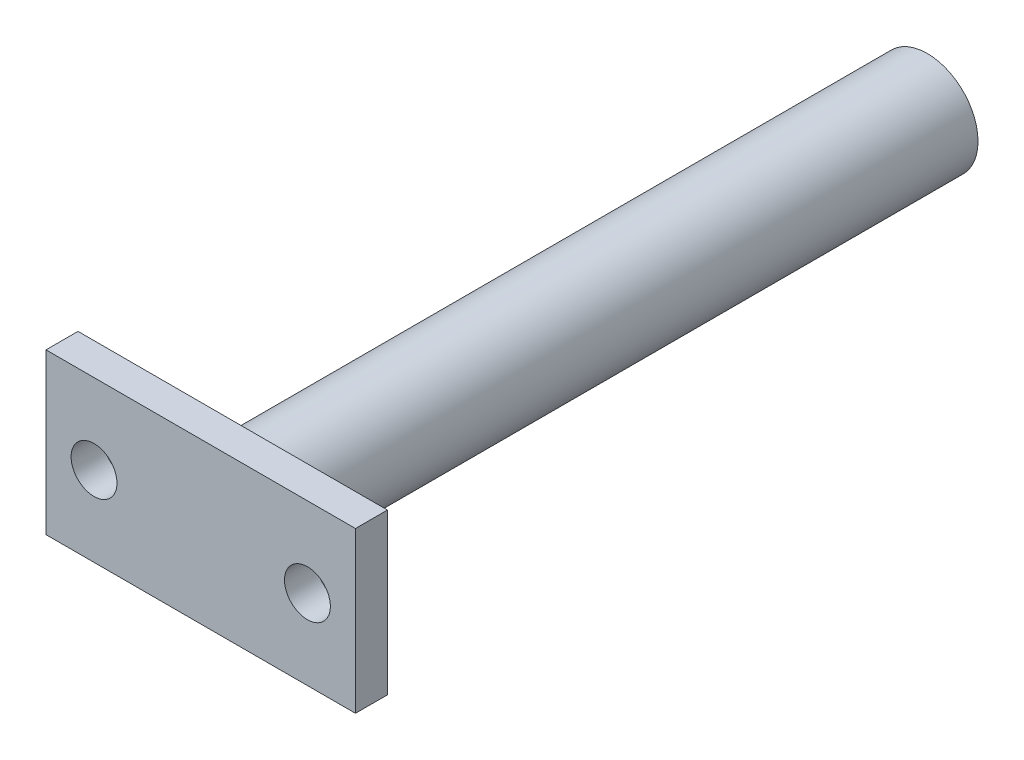
ISO-10303-21;
HEADER;
FILE_DESCRIPTION(('STEP AP214'),'2;1');
FILE_NAME('part.step','',(''),(''),'','','');
FILE_SCHEMA(('AUTOMOTIVE_DESIGN { 1 0 10303 214 1 1 1 1 }'));
ENDSEC;
DATA;
#1=APPLICATION_CONTEXT('core data for automotive mechanical design processes');
#2=APPLICATION_PROTOCOL_DEFINITION('international standard','automotive_design',2000,#1);
#3=PRODUCT_CONTEXT('',#1,'mechanical');
#4=PRODUCT('Part','Part','',(#3));
#5=PRODUCT_RELATED_PRODUCT_CATEGORY('part','',(#4));
#6=PRODUCT_DEFINITION_FORMATION('','',#4);
#7=PRODUCT_DEFINITION_CONTEXT('part definition',#1,'design');
#8=PRODUCT_DEFINITION('design','',#6,#7);
#9=PRODUCT_DEFINITION_SHAPE('','',#8);
#10=(LENGTH_UNIT() NAMED_UNIT(*) SI_UNIT(.MILLI.,.METRE.));
#11=(NAMED_UNIT(*) PLANE_ANGLE_UNIT() SI_UNIT($,.RADIAN.));
#12=(NAMED_UNIT(*) SI_UNIT($,.STERADIAN.) SOLID_ANGLE_UNIT());
#13=UNCERTAINTY_MEASURE_WITH_UNIT(LENGTH_MEASURE(1.E-05),#10,'distance_accuracy_value','');
#14=(GEOMETRIC_REPRESENTATION_CONTEXT(3) GLOBAL_UNCERTAINTY_ASSIGNED_CONTEXT((#13)) GLOBAL_UNIT_ASSIGNED_CONTEXT((#10,
#11,#12)) REPRESENTATION_CONTEXT('',''));
#15=CARTESIAN_POINT('',(0.,0.,0.));
#16=DIRECTION('',(0.,0.,1.));
#17=DIRECTION('',(1.,0.,0.));
#18=AXIS2_PLACEMENT_3D('',#15,#16,#17);
#19=CARTESIAN_POINT('',(-27.6328666396553,0.,3.));
#20=DIRECTION('',(-1.,0.,0.));
#21=DIRECTION('',(0.,0.,1.));
#22=AXIS2_PLACEMENT_3D('',#19,#20,#21);
#23=PLANE('',#22);
#24=DIRECTION('',(0.,1.,0.));
#25=VECTOR('',#24,1.);
#26=CARTESIAN_POINT('',(-27.6328666396553,0.,0.));
#27=LINE('',#26,#25);
#28=CARTESIAN_POINT('',(-27.6328666396553,0.593964388251606,0.));
#29=VERTEX_POINT('',#28);
#30=CARTESIAN_POINT('',(-27.6328666396553,15.5939643882516,0.));
#31=VERTEX_POINT('',#30);
#32=EDGE_CURVE('E106',#29,#31,#27,.T.);
#33=ORIENTED_EDGE('',*,*,#32,.F.);
#34=DIRECTION('',(0.,0.,-1.));
#35=VECTOR('',#34,1.);
#36=CARTESIAN_POINT('',(-27.6328666396553,0.593964388251606,3.));
#37=LINE('',#36,#35);
#38=CARTESIAN_POINT('',(-27.6328666396553,0.593964388251606,3.));
#39=VERTEX_POINT('',#38);
#40=EDGE_CURVE('E11',#39,#29,#37,.T.);
#41=ORIENTED_EDGE('',*,*,#40,.F.);
#42=DIRECTION('',(0.,1.,0.));
#43=VECTOR('',#42,1.);
#44=CARTESIAN_POINT('',(-27.6328666396553,0.,3.));
#45=LINE('',#44,#43);
#46=CARTESIAN_POINT('',(-27.6328666396553,15.5939643882516,3.));
#47=VERTEX_POINT('',#46);
#48=EDGE_CURVE('E90',#39,#47,#45,.T.);
#49=ORIENTED_EDGE('',*,*,#48,.T.);
#50=DIRECTION('',(0.,0.,-1.));
#51=VECTOR('',#50,1.);
#52=CARTESIAN_POINT('',(-27.6328666396553,15.5939643882516,3.));
#53=LINE('',#52,#51);
#54=EDGE_CURVE('E52',#47,#31,#53,.T.);
#55=ORIENTED_EDGE('',*,*,#54,.T.);
#56=EDGE_LOOP('',(#33,#41,#49,#55));
#57=FACE_BOUND('',#56,.T.);
#58=ADVANCED_FACE('F35',(#57),#23,.T.);
#59=CARTESIAN_POINT('',(0.,0.593964388251606,3.));
#60=DIRECTION('',(0.,1.,0.));
#61=DIRECTION('',(0.,0.,1.));
#62=AXIS2_PLACEMENT_3D('',#59,#60,#61);
#63=PLANE('',#62);
#64=DIRECTION('',(1.,0.,0.));
#65=VECTOR('',#64,1.);
#66=CARTESIAN_POINT('',(0.,0.593964388251606,0.));
#67=LINE('',#66,#65);
#68=CARTESIAN_POINT('',(1.3671333603447,0.593964388251606,0.));
#69=VERTEX_POINT('',#68);
#70=EDGE_CURVE('E95',#29,#69,#67,.T.);
#71=ORIENTED_EDGE('',*,*,#70,.T.);
#72=DIRECTION('',(0.,0.,-1.));
#73=VECTOR('',#72,1.);
#74=CARTESIAN_POINT('',(1.3671333603447,0.593964388251606,3.));
#75=LINE('',#74,#73);
#76=CARTESIAN_POINT('',(1.3671333603447,0.593964388251606,3.));
#77=VERTEX_POINT('',#76);
#78=EDGE_CURVE('E44',#77,#69,#75,.T.);
#79=ORIENTED_EDGE('',*,*,#78,.F.);
#80=DIRECTION('',(1.,0.,0.));
#81=VECTOR('',#80,1.);
#82=CARTESIAN_POINT('',(0.,0.593964388251606,3.));
#83=LINE('',#82,#81);
#84=EDGE_CURVE('E86',#39,#77,#83,.T.);
#85=ORIENTED_EDGE('',*,*,#84,.F.);
#86=ORIENTED_EDGE('',*,*,#40,.T.);
#87=EDGE_LOOP('',(#71,#79,#85,#86));
#88=FACE_BOUND('',#87,.T.);
#89=ADVANCED_FACE('F93',(#88),#63,.F.);
#90=CARTESIAN_POINT('',(1.3671333603447,0.,3.));
#91=DIRECTION('',(-1.,0.,0.));
#92=DIRECTION('',(0.,-1.,0.));
#93=AXIS2_PLACEMENT_3D('',#90,#91,#92);
#94=PLANE('',#93);
#95=DIRECTION('',(0.,1.,0.));
#96=VECTOR('',#95,1.);
#97=CARTESIAN_POINT('',(1.3671333603447,0.,0.));
#98=LINE('',#97,#96);
#99=CARTESIAN_POINT('',(1.3671333603447,15.5939643882516,0.));
#100=VERTEX_POINT('',#99);
#101=EDGE_CURVE('E103',#69,#100,#98,.T.);
#102=ORIENTED_EDGE('',*,*,#101,.T.);
#103=DIRECTION('',(0.,0.,-1.));
#104=VECTOR('',#103,1.);
#105=CARTESIAN_POINT('',(1.3671333603447,15.5939643882516,3.));
#106=LINE('',#105,#104);
#107=CARTESIAN_POINT('',(1.3671333603447,15.5939643882516,3.));
#108=VERTEX_POINT('',#107);
#109=EDGE_CURVE('E66',#108,#100,#106,.T.);
#110=ORIENTED_EDGE('',*,*,#109,.F.);
#111=DIRECTION('',(0.,1.,0.));
#112=VECTOR('',#111,1.);
#113=CARTESIAN_POINT('',(1.3671333603447,0.,3.));
#114=LINE('',#113,#112);
#115=EDGE_CURVE('E78',#77,#108,#114,.T.);
#116=ORIENTED_EDGE('',*,*,#115,.F.);
#117=ORIENTED_EDGE('',*,*,#78,.T.);
#118=EDGE_LOOP('',(#102,#110,#116,#117));
#119=FACE_BOUND('',#118,.T.);
#120=ADVANCED_FACE('F80',(#119),#94,.F.);
#121=CARTESIAN_POINT('',(-3.1328666396553,8.09396438825161,3.));
#122=DIRECTION('',(0.,0.,-1.));
#123=DIRECTION('',(-1.,0.,0.));
#124=AXIS2_PLACEMENT_3D('',#121,#122,#123);
#125=CYLINDRICAL_SURFACE('',#124,2.15);
#126=CARTESIAN_POINT('',(-3.1328666396553,8.09396438825161,3.));
#127=DIRECTION('',(0.,0.,1.));
#128=DIRECTION('',(1.,0.,0.));
#129=AXIS2_PLACEMENT_3D('',#126,#127,#128);
#130=CIRCLE('',#129,2.15);
#131=CARTESIAN_POINT('',(-0.982866639655303,8.09396438825161,3.));
#132=VERTEX_POINT('',#131);
#133=EDGE_CURVE('E117',#132,#132,#130,.T.);
#134=ORIENTED_EDGE('',*,*,#133,.T.);
#135=EDGE_LOOP('',(#134));
#136=FACE_BOUND('',#135,.T.);
#137=CARTESIAN_POINT('',(-3.1328666396553,8.09396438825161,0.));
#138=DIRECTION('',(0.,0.,1.));
#139=DIRECTION('',(1.,0.,0.));
#140=AXIS2_PLACEMENT_3D('',#137,#138,#139);
#141=CIRCLE('',#140,2.15);
#142=CARTESIAN_POINT('',(-0.982866639655303,8.09396438825161,0.));
#143=VERTEX_POINT('',#142);
#144=EDGE_CURVE('E108',#143,#143,#141,.T.);
#145=ORIENTED_EDGE('',*,*,#144,.F.);
#146=EDGE_LOOP('',(#145));
#147=FACE_BOUND('',#146,.T.);
#148=ADVANCED_FACE('F149',(#136,#147),#125,.F.);
#149=CARTESIAN_POINT('',(-23.1328666396553,8.09396438825161,3.));
#150=DIRECTION('',(0.,0.,-1.));
#151=DIRECTION('',(-1.,0.,0.));
#152=AXIS2_PLACEMENT_3D('',#149,#150,#151);
#153=CYLINDRICAL_SURFACE('',#152,2.15);
#154=CARTESIAN_POINT('',(-23.1328666396553,8.09396438825161,3.));
#155=DIRECTION('',(0.,0.,1.));
#156=DIRECTION('',(1.,0.,0.));
#157=AXIS2_PLACEMENT_3D('',#154,#155,#156);
#158=CIRCLE('',#157,2.15);
#159=CARTESIAN_POINT('',(-20.9828666396553,8.09396438825161,3.));
#160=VERTEX_POINT('',#159);
#161=EDGE_CURVE('E102',#160,#160,#158,.T.);
#162=ORIENTED_EDGE('',*,*,#161,.T.);
#163=EDGE_LOOP('',(#162));
#164=FACE_BOUND('',#163,.T.);
#165=CARTESIAN_POINT('',(-23.1328666396553,8.09396438825161,0.));
#166=DIRECTION('',(0.,0.,1.));
#167=DIRECTION('',(1.,0.,0.));
#168=AXIS2_PLACEMENT_3D('',#165,#166,#167);
#169=CIRCLE('',#168,2.15);
#170=CARTESIAN_POINT('',(-20.9828666396553,8.09396438825161,0.));
#171=VERTEX_POINT('',#170);
#172=EDGE_CURVE('E111',#171,#171,#169,.T.);
#173=ORIENTED_EDGE('',*,*,#172,.F.);
#174=EDGE_LOOP('',(#173));
#175=FACE_BOUND('',#174,.T.);
#176=ADVANCED_FACE('F37',(#164,#175),#153,.F.);
#177=CARTESIAN_POINT('',(0.,15.5939643882516,3.));
#178=DIRECTION('',(0.,1.,0.));
#179=DIRECTION('',(0.,0.,1.));
#180=AXIS2_PLACEMENT_3D('',#177,#178,#179);
#181=PLANE('',#180);
#182=DIRECTION('',(1.,0.,0.));
#183=VECTOR('',#182,1.);
#184=CARTESIAN_POINT('',(0.,15.5939643882516,0.));
#185=LINE('',#184,#183);
#186=EDGE_CURVE('E99',#31,#100,#185,.T.);
#187=ORIENTED_EDGE('',*,*,#186,.F.);
#188=ORIENTED_EDGE('',*,*,#54,.F.);
#189=DIRECTION('',(1.,0.,0.));
#190=VECTOR('',#189,1.);
#191=CARTESIAN_POINT('',(0.,15.5939643882516,3.));
#192=LINE('',#191,#190);
#193=EDGE_CURVE('E85',#47,#108,#192,.T.);
#194=ORIENTED_EDGE('',*,*,#193,.T.);
#195=ORIENTED_EDGE('',*,*,#109,.T.);
#196=EDGE_LOOP('',(#187,#188,#194,#195));
#197=FACE_BOUND('',#196,.T.);
#198=ADVANCED_FACE('F156',(#197),#181,.T.);
#199=CARTESIAN_POINT('',(0.,0.,3.));
#200=DIRECTION('',(0.,0.,1.));
#201=DIRECTION('',(1.,0.,0.));
#202=AXIS2_PLACEMENT_3D('',#199,#200,#201);
#203=PLANE('',#202);
#204=ORIENTED_EDGE('',*,*,#161,.F.);
#205=EDGE_LOOP('',(#204));
#206=FACE_BOUND('',#205,.T.);
#207=ORIENTED_EDGE('',*,*,#133,.F.);
#208=EDGE_LOOP('',(#207));
#209=FACE_BOUND('',#208,.T.);
#210=ORIENTED_EDGE('',*,*,#48,.F.);
#211=ORIENTED_EDGE('',*,*,#84,.T.);
#212=ORIENTED_EDGE('',*,*,#115,.T.);
#213=ORIENTED_EDGE('',*,*,#193,.F.);
#214=EDGE_LOOP('',(#210,#211,#212,#213));
#215=FACE_BOUND('',#214,.T.);
#216=ADVANCED_FACE('F89',(#206,#209,#215),#203,.T.);
#217=CARTESIAN_POINT('',(0.,0.,0.));
#218=DIRECTION('',(0.,0.,1.));
#219=DIRECTION('',(1.,0.,0.));
#220=AXIS2_PLACEMENT_3D('',#217,#218,#219);
#221=PLANE('',#220);
#222=ORIENTED_EDGE('',*,*,#172,.T.);
#223=EDGE_LOOP('',(#222));
#224=FACE_BOUND('',#223,.T.);
#225=ORIENTED_EDGE('',*,*,#144,.T.);
#226=EDGE_LOOP('',(#225));
#227=FACE_BOUND('',#226,.T.);
#228=CARTESIAN_POINT('',(-13.1403651716582,8.09396438825161,0.));
#229=DIRECTION('',(0.,0.,1.));
#230=DIRECTION('',(1.,0.,0.));
#231=AXIS2_PLACEMENT_3D('',#228,#229,#230);
#232=CIRCLE('',#231,4.75);
#233=CARTESIAN_POINT('',(-8.39036517165817,8.09396438825161,0.));
#234=VERTEX_POINT('',#233);
#235=EDGE_CURVE('E114',#234,#234,#232,.F.);
#236=ORIENTED_EDGE('',*,*,#235,.F.);
#237=EDGE_LOOP('',(#236));
#238=FACE_BOUND('',#237,.T.);
#239=ORIENTED_EDGE('',*,*,#32,.T.);
#240=ORIENTED_EDGE('',*,*,#186,.T.);
#241=ORIENTED_EDGE('',*,*,#101,.F.);
#242=ORIENTED_EDGE('',*,*,#70,.F.);
#243=EDGE_LOOP('',(#239,#240,#241,#242));
#244=FACE_BOUND('',#243,.T.);
#245=ADVANCED_FACE('F133',(#224,#227,#238,#244),#221,.F.);
#246=CARTESIAN_POINT('',(0.,0.,-65.1));
#247=DIRECTION('',(0.,0.,1.));
#248=DIRECTION('',(1.,0.,0.));
#249=AXIS2_PLACEMENT_3D('',#246,#247,#248);
#250=PLANE('',#249);
#251=CARTESIAN_POINT('',(-13.1403651716582,8.09396438825161,-65.1));
#252=DIRECTION('',(0.,0.,1.));
#253=DIRECTION('',(1.,0.,0.));
#254=AXIS2_PLACEMENT_3D('',#251,#252,#253);
#255=CIRCLE('',#254,4.75);
#256=CARTESIAN_POINT('',(-8.39036517165817,8.09396438825161,-65.1));
#257=VERTEX_POINT('',#256);
#258=EDGE_CURVE('E124',#257,#257,#255,.T.);
#259=ORIENTED_EDGE('',*,*,#258,.F.);
#260=EDGE_LOOP('',(#259));
#261=FACE_BOUND('',#260,.T.);
#262=ADVANCED_FACE('F131',(#261),#250,.F.);
#263=CARTESIAN_POINT('',(-13.1403651716582,8.09396438825161,16.4350288425444));
#264=DIRECTION('',(0.,0.,-1.));
#265=DIRECTION('',(-1.,0.,0.));
#266=AXIS2_PLACEMENT_3D('',#263,#264,#265);
#267=CYLINDRICAL_SURFACE('',#266,4.75);
#268=ORIENTED_EDGE('',*,*,#258,.T.);
#269=EDGE_LOOP('',(#268));
#270=FACE_BOUND('',#269,.T.);
#271=ORIENTED_EDGE('',*,*,#235,.T.);
#272=EDGE_LOOP('',(#271));
#273=FACE_BOUND('',#272,.T.);
#274=ADVANCED_FACE('F128',(#270,#273),#267,.T.);
#275=CLOSED_SHELL('',(#58,#89,#120,#148,#176,#198,#216,#245,#262,#274));
#276=MANIFOLD_SOLID_BREP('B2',#275);
#277=ADVANCED_BREP_SHAPE_REPRESENTATION('',(#18,#276),#14);
#278=SHAPE_DEFINITION_REPRESENTATION(#9,#277);
ENDSEC;
END-ISO-10303-21;
